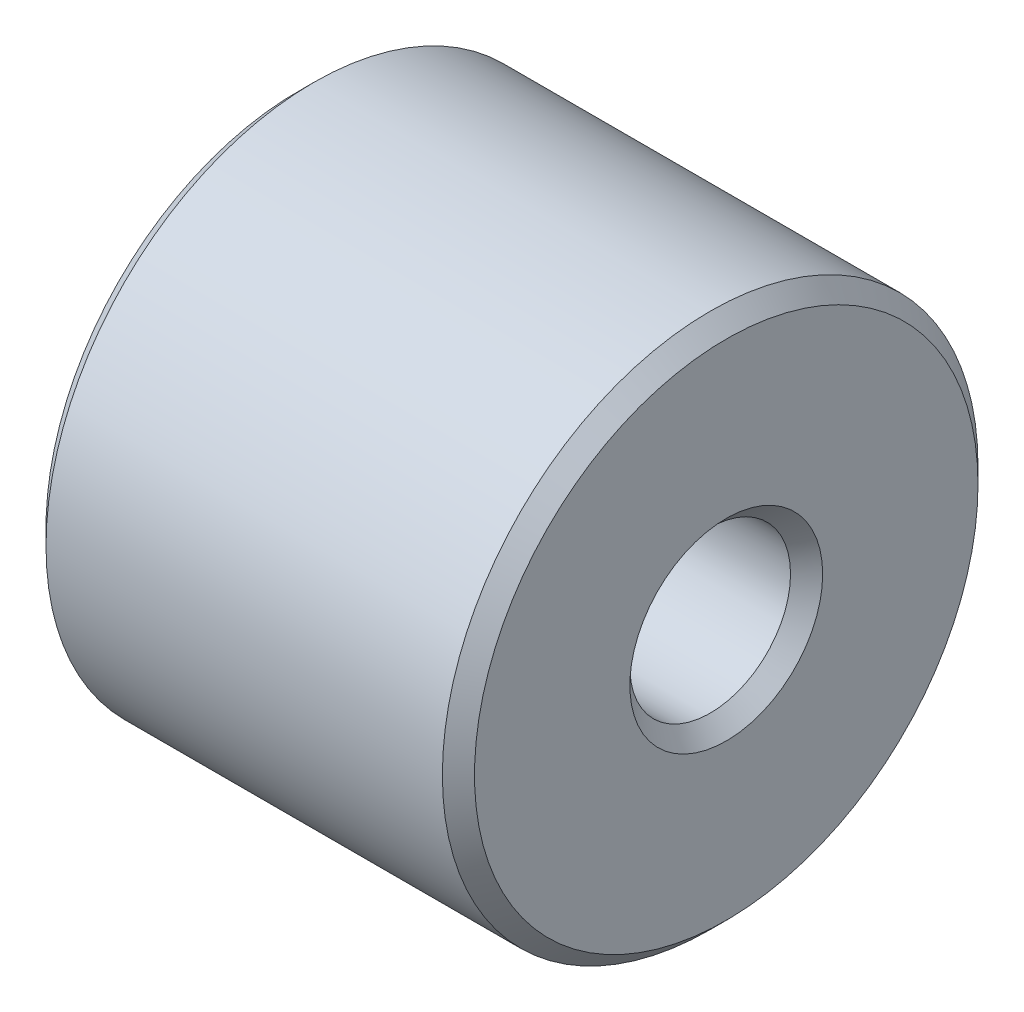
ISO-10303-21;
HEADER;
FILE_DESCRIPTION(('STEP AP214'),'2;1');
FILE_NAME('part.step','',(''),(''),'','','');
FILE_SCHEMA(('AUTOMOTIVE_DESIGN { 1 0 10303 214 1 1 1 1 }'));
ENDSEC;
DATA;
#1=APPLICATION_CONTEXT('core data for automotive mechanical design processes');
#2=APPLICATION_PROTOCOL_DEFINITION('international standard','automotive_design',2000,#1);
#3=PRODUCT_CONTEXT('',#1,'mechanical');
#4=PRODUCT('Part','Part','',(#3));
#5=PRODUCT_RELATED_PRODUCT_CATEGORY('part','',(#4));
#6=PRODUCT_DEFINITION_FORMATION('','',#4);
#7=PRODUCT_DEFINITION_CONTEXT('part definition',#1,'design');
#8=PRODUCT_DEFINITION('design','',#6,#7);
#9=PRODUCT_DEFINITION_SHAPE('','',#8);
#10=(LENGTH_UNIT() NAMED_UNIT(*) SI_UNIT(.MILLI.,.METRE.));
#11=(NAMED_UNIT(*) PLANE_ANGLE_UNIT() SI_UNIT($,.RADIAN.));
#12=(NAMED_UNIT(*) SI_UNIT($,.STERADIAN.) SOLID_ANGLE_UNIT());
#13=UNCERTAINTY_MEASURE_WITH_UNIT(LENGTH_MEASURE(1.E-05),#10,'distance_accuracy_value','');
#14=(GEOMETRIC_REPRESENTATION_CONTEXT(3) GLOBAL_UNCERTAINTY_ASSIGNED_CONTEXT((#13)) GLOBAL_UNIT_ASSIGNED_CONTEXT((#10,
#11,#12)) REPRESENTATION_CONTEXT('',''));
#15=CARTESIAN_POINT('',(0.,0.,0.));
#16=DIRECTION('',(0.,0.,1.));
#17=DIRECTION('',(1.,0.,0.));
#18=AXIS2_PLACEMENT_3D('',#15,#16,#17);
#19=CARTESIAN_POINT('',(4.,0.,0.));
#20=DIRECTION('',(1.,0.,0.));
#21=DIRECTION('',(0.,0.,-1.));
#22=AXIS2_PLACEMENT_3D('',#19,#20,#21);
#23=PLANE('',#22);
#24=CARTESIAN_POINT('',(4.,0.,0.));
#25=DIRECTION('',(1.,0.,0.));
#26=DIRECTION('',(0.,0.,-1.));
#27=AXIS2_PLACEMENT_3D('',#24,#25,#26);
#28=CIRCLE('',#27,0.900000000000002);
#29=CARTESIAN_POINT('',(4.,0.,-0.900000000000002));
#30=VERTEX_POINT('',#29);
#31=EDGE_CURVE('E10',#30,#30,#28,.F.);
#32=ORIENTED_EDGE('',*,*,#31,.T.);
#33=EDGE_LOOP('',(#32));
#34=FACE_BOUND('',#33,.T.);
#35=CARTESIAN_POINT('',(4.,0.,0.));
#36=DIRECTION('',(1.,0.,0.));
#37=DIRECTION('',(0.,0.,-1.));
#38=AXIS2_PLACEMENT_3D('',#35,#36,#37);
#39=CIRCLE('',#38,2.35);
#40=CARTESIAN_POINT('',(4.,0.,-2.35));
#41=VERTEX_POINT('',#40);
#42=EDGE_CURVE('E41',#41,#41,#39,.T.);
#43=ORIENTED_EDGE('',*,*,#42,.T.);
#44=EDGE_LOOP('',(#43));
#45=FACE_BOUND('',#44,.T.);
#46=ADVANCED_FACE('F33',(#34,#45),#23,.T.);
#47=CARTESIAN_POINT('',(0.,0.,0.));
#48=DIRECTION('',(1.,0.,0.));
#49=DIRECTION('',(0.,0.,-1.));
#50=AXIS2_PLACEMENT_3D('',#47,#48,#49);
#51=PLANE('',#50);
#52=CARTESIAN_POINT('',(0.,0.,0.));
#53=DIRECTION('',(1.,0.,0.));
#54=DIRECTION('',(0.,0.,-1.));
#55=AXIS2_PLACEMENT_3D('',#52,#53,#54);
#56=CIRCLE('',#55,0.9);
#57=CARTESIAN_POINT('',(0.,0.,-0.9));
#58=VERTEX_POINT('',#57);
#59=EDGE_CURVE('E60',#58,#58,#56,.T.);
#60=ORIENTED_EDGE('',*,*,#59,.T.);
#61=EDGE_LOOP('',(#60));
#62=FACE_BOUND('',#61,.T.);
#63=CARTESIAN_POINT('',(0.,0.,0.));
#64=DIRECTION('',(1.,0.,0.));
#65=DIRECTION('',(0.,0.,-1.));
#66=AXIS2_PLACEMENT_3D('',#63,#64,#65);
#67=CIRCLE('',#66,2.35);
#68=CARTESIAN_POINT('',(0.,0.,-2.35));
#69=VERTEX_POINT('',#68);
#70=EDGE_CURVE('E63',#69,#69,#67,.F.);
#71=ORIENTED_EDGE('',*,*,#70,.T.);
#72=EDGE_LOOP('',(#71));
#73=FACE_BOUND('',#72,.T.);
#74=ADVANCED_FACE('F67',(#62,#73),#51,.F.);
#75=CARTESIAN_POINT('',(4.,0.,0.));
#76=DIRECTION('',(-1.,0.,0.));
#77=DIRECTION('',(0.,0.,1.));
#78=AXIS2_PLACEMENT_3D('',#75,#76,#77);
#79=CYLINDRICAL_SURFACE('',#78,2.5);
#80=CARTESIAN_POINT('',(0.150000000000001,0.,0.));
#81=DIRECTION('',(1.,0.,0.));
#82=DIRECTION('',(0.,0.,-1.));
#83=AXIS2_PLACEMENT_3D('',#80,#81,#82);
#84=CIRCLE('',#83,2.5);
#85=CARTESIAN_POINT('',(0.150000000000001,0.,-2.5));
#86=VERTEX_POINT('',#85);
#87=EDGE_CURVE('E45',#86,#86,#84,.T.);
#88=ORIENTED_EDGE('',*,*,#87,.T.);
#89=EDGE_LOOP('',(#88));
#90=FACE_BOUND('',#89,.T.);
#91=CARTESIAN_POINT('',(3.85,0.,0.));
#92=DIRECTION('',(1.,0.,0.));
#93=DIRECTION('',(0.,0.,-1.));
#94=AXIS2_PLACEMENT_3D('',#91,#92,#93);
#95=CIRCLE('',#94,2.5);
#96=CARTESIAN_POINT('',(3.85,0.,-2.5));
#97=VERTEX_POINT('',#96);
#98=EDGE_CURVE('E49',#97,#97,#95,.F.);
#99=ORIENTED_EDGE('',*,*,#98,.T.);
#100=EDGE_LOOP('',(#99));
#101=FACE_BOUND('',#100,.T.);
#102=ADVANCED_FACE('F77',(#90,#101),#79,.T.);
#103=CARTESIAN_POINT('',(4.,0.,0.));
#104=DIRECTION('',(-1.,0.,0.));
#105=DIRECTION('',(0.,0.,1.));
#106=AXIS2_PLACEMENT_3D('',#103,#104,#105);
#107=CYLINDRICAL_SURFACE('',#106,0.75);
#108=CARTESIAN_POINT('',(0.149999999999999,0.,0.));
#109=DIRECTION('',(1.,0.,0.));
#110=DIRECTION('',(0.,0.,-1.));
#111=AXIS2_PLACEMENT_3D('',#108,#109,#110);
#112=CIRCLE('',#111,0.75);
#113=CARTESIAN_POINT('',(0.149999999999999,0.,-0.75));
#114=VERTEX_POINT('',#113);
#115=EDGE_CURVE('E54',#114,#114,#112,.F.);
#116=ORIENTED_EDGE('',*,*,#115,.T.);
#117=EDGE_LOOP('',(#116));
#118=FACE_BOUND('',#117,.T.);
#119=CARTESIAN_POINT('',(3.85,0.,0.));
#120=DIRECTION('',(1.,0.,0.));
#121=DIRECTION('',(0.,0.,-1.));
#122=AXIS2_PLACEMENT_3D('',#119,#120,#121);
#123=CIRCLE('',#122,0.75);
#124=CARTESIAN_POINT('',(3.85,0.,-0.75));
#125=VERTEX_POINT('',#124);
#126=EDGE_CURVE('E57',#125,#125,#123,.T.);
#127=ORIENTED_EDGE('',*,*,#126,.T.);
#128=EDGE_LOOP('',(#127));
#129=FACE_BOUND('',#128,.T.);
#130=ADVANCED_FACE('F80',(#118,#129),#107,.F.);
#131=CARTESIAN_POINT('',(0.,0.,0.));
#132=DIRECTION('',(-1.,0.,0.));
#133=DIRECTION('',(0.,0.,1.));
#134=AXIS2_PLACEMENT_3D('',#131,#132,#133);
#135=CONICAL_SURFACE('',#134,0.9,0.78539816339745);
#136=ORIENTED_EDGE('',*,*,#115,.F.);
#137=EDGE_LOOP('',(#136));
#138=FACE_BOUND('',#137,.T.);
#139=ORIENTED_EDGE('',*,*,#59,.F.);
#140=EDGE_LOOP('',(#139));
#141=FACE_BOUND('',#140,.T.);
#142=ADVANCED_FACE('F73',(#138,#141),#135,.F.);
#143=CARTESIAN_POINT('',(0.150000000000001,0.,0.));
#144=DIRECTION('',(1.,0.,0.));
#145=DIRECTION('',(0.,0.,-1.));
#146=AXIS2_PLACEMENT_3D('',#143,#144,#145);
#147=CONICAL_SURFACE('',#146,2.5,0.78539816339745);
#148=ORIENTED_EDGE('',*,*,#70,.F.);
#149=EDGE_LOOP('',(#148));
#150=FACE_BOUND('',#149,.T.);
#151=ORIENTED_EDGE('',*,*,#87,.F.);
#152=EDGE_LOOP('',(#151));
#153=FACE_BOUND('',#152,.T.);
#154=ADVANCED_FACE('F69',(#150,#153),#147,.T.);
#155=CARTESIAN_POINT('',(3.85,0.,0.));
#156=DIRECTION('',(1.,0.,0.));
#157=DIRECTION('',(0.,0.,-1.));
#158=AXIS2_PLACEMENT_3D('',#155,#156,#157);
#159=CONICAL_SURFACE('',#158,0.75,0.785398163397453);
#160=ORIENTED_EDGE('',*,*,#31,.F.);
#161=EDGE_LOOP('',(#160));
#162=FACE_BOUND('',#161,.T.);
#163=ORIENTED_EDGE('',*,*,#126,.F.);
#164=EDGE_LOOP('',(#163));
#165=FACE_BOUND('',#164,.T.);
#166=ADVANCED_FACE('F72',(#162,#165),#159,.F.);
#167=CARTESIAN_POINT('',(4.,0.,0.));
#168=DIRECTION('',(-1.,0.,0.));
#169=DIRECTION('',(0.,0.,1.));
#170=AXIS2_PLACEMENT_3D('',#167,#168,#169);
#171=CONICAL_SURFACE('',#170,2.35,0.785398163397445);
#172=ORIENTED_EDGE('',*,*,#98,.F.);
#173=EDGE_LOOP('',(#172));
#174=FACE_BOUND('',#173,.T.);
#175=ORIENTED_EDGE('',*,*,#42,.F.);
#176=EDGE_LOOP('',(#175));
#177=FACE_BOUND('',#176,.T.);
#178=ADVANCED_FACE('F36',(#174,#177),#171,.T.);
#179=CLOSED_SHELL('',(#46,#74,#102,#130,#142,#154,#166,#178));
#180=MANIFOLD_SOLID_BREP('B2',#179);
#181=ADVANCED_BREP_SHAPE_REPRESENTATION('',(#18,#180),#14);
#182=SHAPE_DEFINITION_REPRESENTATION(#9,#181);
ENDSEC;
END-ISO-10303-21;
